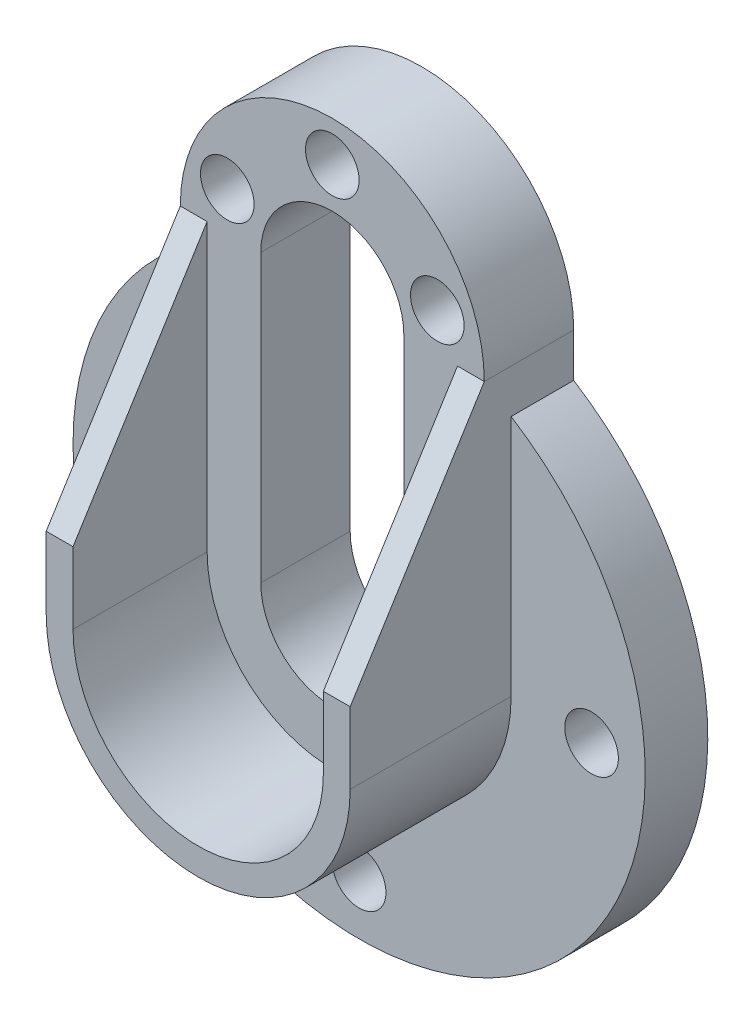
ISO-10303-21;
HEADER;
FILE_DESCRIPTION(('STEP AP214'),'2;1');
FILE_NAME('part.step','',(''),(''),'','','');
FILE_SCHEMA(('AUTOMOTIVE_DESIGN { 1 0 10303 214 1 1 1 1 }'));
ENDSEC;
DATA;
#1=APPLICATION_CONTEXT('core data for automotive mechanical design processes');
#2=APPLICATION_PROTOCOL_DEFINITION('international standard','automotive_design',2000,#1);
#3=PRODUCT_CONTEXT('',#1,'mechanical');
#4=PRODUCT('Part','Part','',(#3));
#5=PRODUCT_RELATED_PRODUCT_CATEGORY('part','',(#4));
#6=PRODUCT_DEFINITION_FORMATION('','',#4);
#7=PRODUCT_DEFINITION_CONTEXT('part definition',#1,'design');
#8=PRODUCT_DEFINITION('design','',#6,#7);
#9=PRODUCT_DEFINITION_SHAPE('','',#8);
#10=(LENGTH_UNIT() NAMED_UNIT(*) SI_UNIT(.MILLI.,.METRE.));
#11=(NAMED_UNIT(*) PLANE_ANGLE_UNIT() SI_UNIT($,.RADIAN.));
#12=(NAMED_UNIT(*) SI_UNIT($,.STERADIAN.) SOLID_ANGLE_UNIT());
#13=UNCERTAINTY_MEASURE_WITH_UNIT(LENGTH_MEASURE(1.E-05),#10,'distance_accuracy_value','');
#14=(GEOMETRIC_REPRESENTATION_CONTEXT(3) GLOBAL_UNCERTAINTY_ASSIGNED_CONTEXT((#13)) GLOBAL_UNIT_ASSIGNED_CONTEXT((#10,
#11,#12)) REPRESENTATION_CONTEXT('',''));
#15=CARTESIAN_POINT('',(0.,0.,0.));
#16=DIRECTION('',(0.,0.,1.));
#17=DIRECTION('',(1.,0.,0.));
#18=AXIS2_PLACEMENT_3D('',#15,#16,#17);
#19=CARTESIAN_POINT('',(0.,0.,15.875));
#20=DIRECTION('',(0.,0.,1.));
#21=DIRECTION('',(1.,0.,0.));
#22=AXIS2_PLACEMENT_3D('',#19,#20,#21);
#23=PLANE('',#22);
#24=DIRECTION('',(0.,-1.,0.));
#25=VECTOR('',#24,1.);
#26=CARTESIAN_POINT('',(-12.7,0.,15.875));
#27=LINE('',#26,#25);
#28=CARTESIAN_POINT('',(-12.7,50.8,15.875));
#29=VERTEX_POINT('',#28);
#30=CARTESIAN_POINT('',(-12.7,0.,15.875));
#31=VERTEX_POINT('',#30);
#32=EDGE_CURVE('E179',#29,#31,#27,.T.);
#33=ORIENTED_EDGE('',*,*,#32,.F.);
#34=CARTESIAN_POINT('',(0.,50.8,15.875));
#35=DIRECTION('',(0.,0.,1.));
#36=DIRECTION('',(1.,0.,0.));
#37=AXIS2_PLACEMENT_3D('',#34,#35,#36);
#38=CIRCLE('',#37,12.7);
#39=CARTESIAN_POINT('',(12.7,50.8,15.875));
#40=VERTEX_POINT('',#39);
#41=EDGE_CURVE('E182',#40,#29,#38,.T.);
#42=ORIENTED_EDGE('',*,*,#41,.F.);
#43=DIRECTION('',(0.,-1.,0.));
#44=VECTOR('',#43,1.);
#45=CARTESIAN_POINT('',(12.7,0.,15.875));
#46=LINE('',#45,#44);
#47=CARTESIAN_POINT('',(12.7,0.,15.875));
#48=VERTEX_POINT('',#47);
#49=EDGE_CURVE('E185',#40,#48,#46,.T.);
#50=ORIENTED_EDGE('',*,*,#49,.T.);
#51=CARTESIAN_POINT('',(0.,0.,15.875));
#52=DIRECTION('',(0.,0.,1.));
#53=DIRECTION('',(1.,0.,0.));
#54=AXIS2_PLACEMENT_3D('',#51,#52,#53);
#55=CIRCLE('',#54,12.7);
#56=EDGE_CURVE('E176',#31,#48,#55,.T.);
#57=ORIENTED_EDGE('',*,*,#56,.F.);
#58=EDGE_LOOP('',(#33,#42,#50,#57));
#59=FACE_BOUND('',#58,.T.);
#60=DIRECTION('',(1.,0.,0.));
#61=VECTOR('',#60,1.);
#62=CARTESIAN_POINT('',(0.,50.8,15.875));
#63=LINE('',#62,#61);
#64=CARTESIAN_POINT('',(-26.9875,50.8,15.875));
#65=VERTEX_POINT('',#64);
#66=CARTESIAN_POINT('',(-22.225,50.8,15.875));
#67=VERTEX_POINT('',#66);
#68=EDGE_CURVE('E146',#65,#67,#63,.T.);
#69=ORIENTED_EDGE('',*,*,#68,.T.);
#70=DIRECTION('',(0.,-1.,0.));
#71=VECTOR('',#70,1.);
#72=CARTESIAN_POINT('',(-22.225,0.,15.875));
#73=LINE('',#72,#71);
#74=CARTESIAN_POINT('',(-22.225,0.,15.875));
#75=VERTEX_POINT('',#74);
#76=EDGE_CURVE('E287',#67,#75,#73,.T.);
#77=ORIENTED_EDGE('',*,*,#76,.T.);
#78=CARTESIAN_POINT('',(0.,0.,15.875));
#79=DIRECTION('',(0.,0.,1.));
#80=DIRECTION('',(1.,0.,0.));
#81=AXIS2_PLACEMENT_3D('',#78,#79,#80);
#82=CIRCLE('',#81,22.225);
#83=CARTESIAN_POINT('',(22.225,0.,15.875));
#84=VERTEX_POINT('',#83);
#85=EDGE_CURVE('E284',#84,#75,#82,.F.);
#86=ORIENTED_EDGE('',*,*,#85,.F.);
#87=DIRECTION('',(0.,-1.,0.));
#88=VECTOR('',#87,1.);
#89=CARTESIAN_POINT('',(22.225,0.,15.875));
#90=LINE('',#89,#88);
#91=CARTESIAN_POINT('',(22.225,50.8,15.875));
#92=VERTEX_POINT('',#91);
#93=EDGE_CURVE('E270',#92,#84,#90,.T.);
#94=ORIENTED_EDGE('',*,*,#93,.F.);
#95=DIRECTION('',(-1.,0.,0.));
#96=VECTOR('',#95,1.);
#97=CARTESIAN_POINT('',(0.,50.8,15.875));
#98=LINE('',#97,#96);
#99=CARTESIAN_POINT('',(26.9875,50.8,15.875));
#100=VERTEX_POINT('',#99);
#101=EDGE_CURVE('E282',#100,#92,#98,.T.);
#102=ORIENTED_EDGE('',*,*,#101,.F.);
#103=CARTESIAN_POINT('',(0.,50.8,15.875));
#104=DIRECTION('',(0.,0.,1.));
#105=DIRECTION('',(1.,0.,0.));
#106=AXIS2_PLACEMENT_3D('',#103,#104,#105);
#107=CIRCLE('',#106,26.9875);
#108=EDGE_CURVE('E173',#100,#65,#107,.T.);
#109=ORIENTED_EDGE('',*,*,#108,.T.);
#110=EDGE_LOOP('',(#69,#77,#86,#94,#102,#109));
#111=FACE_BOUND('',#110,.T.);
#112=CARTESIAN_POINT('',(-18.6470254437204,57.5869622191188,15.875));
#113=DIRECTION('',(0.,0.,1.));
#114=DIRECTION('',(1.,0.,0.));
#115=AXIS2_PLACEMENT_3D('',#112,#113,#114);
#116=CIRCLE('',#115,4.7625);
#117=CARTESIAN_POINT('',(-13.8845254437204,57.5869622191188,15.875));
#118=VERTEX_POINT('',#117);
#119=EDGE_CURVE('E188',#118,#118,#116,.T.);
#120=ORIENTED_EDGE('',*,*,#119,.F.);
#121=EDGE_LOOP('',(#120));
#122=FACE_BOUND('',#121,.T.);
#123=CARTESIAN_POINT('',(0.,70.64375,15.875));
#124=DIRECTION('',(0.,0.,1.));
#125=DIRECTION('',(1.,0.,0.));
#126=AXIS2_PLACEMENT_3D('',#123,#124,#125);
#127=CIRCLE('',#126,4.7625);
#128=CARTESIAN_POINT('',(4.7625,70.64375,15.875));
#129=VERTEX_POINT('',#128);
#130=EDGE_CURVE('E191',#129,#129,#127,.T.);
#131=ORIENTED_EDGE('',*,*,#130,.F.);
#132=EDGE_LOOP('',(#131));
#133=FACE_BOUND('',#132,.T.);
#134=CARTESIAN_POINT('',(18.6470254437203,57.5869622191188,15.875));
#135=DIRECTION('',(0.,0.,1.));
#136=DIRECTION('',(1.,0.,0.));
#137=AXIS2_PLACEMENT_3D('',#134,#135,#136);
#138=CIRCLE('',#137,4.7625);
#139=CARTESIAN_POINT('',(23.4095254437203,57.5869622191188,15.875));
#140=VERTEX_POINT('',#139);
#141=EDGE_CURVE('E194',#140,#140,#138,.F.);
#142=ORIENTED_EDGE('',*,*,#141,.T.);
#143=EDGE_LOOP('',(#142));
#144=FACE_BOUND('',#143,.T.);
#145=ADVANCED_FACE('F35',(#59,#111,#122,#133,#144),#23,.T.);
#146=CARTESIAN_POINT('',(0.,0.,11.1125));
#147=DIRECTION('',(0.,0.,1.));
#148=DIRECTION('',(1.,0.,0.));
#149=AXIS2_PLACEMENT_3D('',#146,#147,#148);
#150=PLANE('',#149);
#151=CARTESIAN_POINT('',(41.275,0.,11.1125));
#152=DIRECTION('',(0.,0.,1.));
#153=DIRECTION('',(1.,0.,0.));
#154=AXIS2_PLACEMENT_3D('',#151,#152,#153);
#155=CIRCLE('',#154,4.7625);
#156=CARTESIAN_POINT('',(46.0375,0.,11.1125));
#157=VERTEX_POINT('',#156);
#158=EDGE_CURVE('E221',#157,#157,#155,.T.);
#159=ORIENTED_EDGE('',*,*,#158,.F.);
#160=EDGE_LOOP('',(#159));
#161=FACE_BOUND('',#160,.T.);
#162=CARTESIAN_POINT('',(-1.4411089226075E-13,-41.275,11.1125));
#163=DIRECTION('',(0.,0.,1.));
#164=DIRECTION('',(1.,0.,0.));
#165=AXIS2_PLACEMENT_3D('',#162,#163,#164);
#166=CIRCLE('',#165,4.7625);
#167=CARTESIAN_POINT('',(4.76249999999985,-41.275,11.1125));
#168=VERTEX_POINT('',#167);
#169=EDGE_CURVE('E218',#168,#168,#166,.T.);
#170=ORIENTED_EDGE('',*,*,#169,.F.);
#171=EDGE_LOOP('',(#170));
#172=FACE_BOUND('',#171,.T.);
#173=CARTESIAN_POINT('',(-41.275,2.88221784521501E-13,11.1125));
#174=DIRECTION('',(0.,0.,1.));
#175=DIRECTION('',(1.,0.,0.));
#176=AXIS2_PLACEMENT_3D('',#173,#174,#175);
#177=CIRCLE('',#176,4.76249999999999);
#178=CARTESIAN_POINT('',(-36.5125,2.88221784521501E-13,11.1125));
#179=VERTEX_POINT('',#178);
#180=EDGE_CURVE('E214',#179,#179,#177,.T.);
#181=ORIENTED_EDGE('',*,*,#180,.F.);
#182=EDGE_LOOP('',(#181));
#183=FACE_BOUND('',#182,.T.);
#184=CARTESIAN_POINT('',(0.,0.,11.1125));
#185=DIRECTION('',(0.,0.,1.));
#186=DIRECTION('',(1.,0.,0.));
#187=AXIS2_PLACEMENT_3D('',#184,#185,#186);
#188=CIRCLE('',#187,26.9875);
#189=CARTESIAN_POINT('',(26.9875,0.,11.1125));
#190=VERTEX_POINT('',#189);
#191=CARTESIAN_POINT('',(-26.9875,0.,11.1125));
#192=VERTEX_POINT('',#191);
#193=EDGE_CURVE('E205',#190,#192,#188,.F.);
#194=ORIENTED_EDGE('',*,*,#193,.T.);
#195=DIRECTION('',(0.,1.,0.));
#196=VECTOR('',#195,1.);
#197=CARTESIAN_POINT('',(-26.9875,0.,11.1125));
#198=LINE('',#197,#196);
#199=CARTESIAN_POINT('',(-26.9875,43.0385274347299,11.1125));
#200=VERTEX_POINT('',#199);
#201=EDGE_CURVE('E208',#192,#200,#198,.T.);
#202=ORIENTED_EDGE('',*,*,#201,.T.);
#203=CARTESIAN_POINT('',(0.,0.,11.1125));
#204=DIRECTION('',(0.,0.,1.));
#205=DIRECTION('',(1.,0.,0.));
#206=AXIS2_PLACEMENT_3D('',#203,#204,#205);
#207=CIRCLE('',#206,50.8);
#208=CARTESIAN_POINT('',(26.9875,43.0385274347299,11.1125));
#209=VERTEX_POINT('',#208);
#210=EDGE_CURVE('E211',#200,#209,#207,.T.);
#211=ORIENTED_EDGE('',*,*,#210,.T.);
#212=DIRECTION('',(0.,-1.,0.));
#213=VECTOR('',#212,1.);
#214=CARTESIAN_POINT('',(26.9875,0.,11.1125));
#215=LINE('',#214,#213);
#216=EDGE_CURVE('E202',#209,#190,#215,.T.);
#217=ORIENTED_EDGE('',*,*,#216,.T.);
#218=EDGE_LOOP('',(#194,#202,#211,#217));
#219=FACE_BOUND('',#218,.T.);
#220=ADVANCED_FACE('F324',(#161,#172,#183,#219),#150,.T.);
#221=CARTESIAN_POINT('',(0.,0.,11.1125));
#222=DIRECTION('',(0.,0.,-1.));
#223=DIRECTION('',(-1.,0.,0.));
#224=AXIS2_PLACEMENT_3D('',#221,#222,#223);
#225=CYLINDRICAL_SURFACE('',#224,12.7);
#226=CARTESIAN_POINT('',(0.,0.,0.));
#227=DIRECTION('',(0.,0.,1.));
#228=DIRECTION('',(1.,0.,0.));
#229=AXIS2_PLACEMENT_3D('',#226,#227,#228);
#230=CIRCLE('',#229,12.7);
#231=CARTESIAN_POINT('',(-12.7,0.,0.));
#232=VERTEX_POINT('',#231);
#233=CARTESIAN_POINT('',(12.7,0.,0.));
#234=VERTEX_POINT('',#233);
#235=EDGE_CURVE('E241',#232,#234,#230,.T.);
#236=ORIENTED_EDGE('',*,*,#235,.F.);
#237=DIRECTION('',(0.,0.,-1.));
#238=VECTOR('',#237,1.);
#239=CARTESIAN_POINT('',(-12.7,0.,11.1125));
#240=LINE('',#239,#238);
#241=EDGE_CURVE('E268',#31,#232,#240,.T.);
#242=ORIENTED_EDGE('',*,*,#241,.F.);
#243=ORIENTED_EDGE('',*,*,#56,.T.);
#244=DIRECTION('',(0.,0.,-1.));
#245=VECTOR('',#244,1.);
#246=CARTESIAN_POINT('',(12.7,0.,11.1125));
#247=LINE('',#246,#245);
#248=EDGE_CURVE('E261',#48,#234,#247,.T.);
#249=ORIENTED_EDGE('',*,*,#248,.T.);
#250=EDGE_LOOP('',(#236,#242,#243,#249));
#251=FACE_BOUND('',#250,.T.);
#252=ADVANCED_FACE('F349',(#251),#225,.F.);
#253=CARTESIAN_POINT('',(-12.7,0.,11.1125));
#254=DIRECTION('',(1.,0.,0.));
#255=DIRECTION('',(0.,1.,0.));
#256=AXIS2_PLACEMENT_3D('',#253,#254,#255);
#257=PLANE('',#256);
#258=DIRECTION('',(0.,-1.,0.));
#259=VECTOR('',#258,1.);
#260=CARTESIAN_POINT('',(-12.7,0.,0.));
#261=LINE('',#260,#259);
#262=CARTESIAN_POINT('',(-12.7,50.8,0.));
#263=VERTEX_POINT('',#262);
#264=EDGE_CURVE('E244',#263,#232,#261,.T.);
#265=ORIENTED_EDGE('',*,*,#264,.F.);
#266=DIRECTION('',(0.,0.,-1.));
#267=VECTOR('',#266,1.);
#268=CARTESIAN_POINT('',(-12.7,50.8,11.1125));
#269=LINE('',#268,#267);
#270=EDGE_CURVE('E266',#29,#263,#269,.T.);
#271=ORIENTED_EDGE('',*,*,#270,.F.);
#272=ORIENTED_EDGE('',*,*,#32,.T.);
#273=ORIENTED_EDGE('',*,*,#241,.T.);
#274=EDGE_LOOP('',(#265,#271,#272,#273));
#275=FACE_BOUND('',#274,.T.);
#276=ADVANCED_FACE('F340',(#275),#257,.T.);
#277=CARTESIAN_POINT('',(0.,50.8,11.1125));
#278=DIRECTION('',(0.,0.,-1.));
#279=DIRECTION('',(-1.,0.,0.));
#280=AXIS2_PLACEMENT_3D('',#277,#278,#279);
#281=CYLINDRICAL_SURFACE('',#280,12.7);
#282=CARTESIAN_POINT('',(0.,50.8,0.));
#283=DIRECTION('',(0.,0.,1.));
#284=DIRECTION('',(1.,0.,0.));
#285=AXIS2_PLACEMENT_3D('',#282,#283,#284);
#286=CIRCLE('',#285,12.7);
#287=CARTESIAN_POINT('',(12.7,50.8,0.));
#288=VERTEX_POINT('',#287);
#289=EDGE_CURVE('E247',#288,#263,#286,.T.);
#290=ORIENTED_EDGE('',*,*,#289,.F.);
#291=DIRECTION('',(0.,0.,-1.));
#292=VECTOR('',#291,1.);
#293=CARTESIAN_POINT('',(12.7,50.8,11.1125));
#294=LINE('',#293,#292);
#295=EDGE_CURVE('E263',#40,#288,#294,.T.);
#296=ORIENTED_EDGE('',*,*,#295,.F.);
#297=ORIENTED_EDGE('',*,*,#41,.T.);
#298=ORIENTED_EDGE('',*,*,#270,.T.);
#299=EDGE_LOOP('',(#290,#296,#297,#298));
#300=FACE_BOUND('',#299,.T.);
#301=ADVANCED_FACE('F335',(#300),#281,.F.);
#302=CARTESIAN_POINT('',(0.,50.8,11.1125));
#303=DIRECTION('',(0.,0.,-1.));
#304=DIRECTION('',(-1.,0.,0.));
#305=AXIS2_PLACEMENT_3D('',#302,#303,#304);
#306=CYLINDRICAL_SURFACE('',#305,26.9875);
#307=CARTESIAN_POINT('',(0.,50.8,0.));
#308=DIRECTION('',(0.,0.,1.));
#309=DIRECTION('',(1.,0.,0.));
#310=AXIS2_PLACEMENT_3D('',#307,#308,#309);
#311=CIRCLE('',#310,26.9875);
#312=CARTESIAN_POINT('',(26.9875,50.8,0.));
#313=VERTEX_POINT('',#312);
#314=CARTESIAN_POINT('',(-26.9875,50.8,0.));
#315=VERTEX_POINT('',#314);
#316=EDGE_CURVE('E210',#313,#315,#311,.T.);
#317=ORIENTED_EDGE('',*,*,#316,.T.);
#318=DIRECTION('',(0.,0.,-1.));
#319=VECTOR('',#318,1.);
#320=CARTESIAN_POINT('',(-26.9875,50.8,11.1125));
#321=LINE('',#320,#319);
#322=EDGE_CURVE('E264',#65,#315,#321,.T.);
#323=ORIENTED_EDGE('',*,*,#322,.F.);
#324=ORIENTED_EDGE('',*,*,#108,.F.);
#325=DIRECTION('',(0.,0.,-1.));
#326=VECTOR('',#325,1.);
#327=CARTESIAN_POINT('',(26.9875,50.8,11.1125));
#328=LINE('',#327,#326);
#329=EDGE_CURVE('E153',#100,#313,#328,.T.);
#330=ORIENTED_EDGE('',*,*,#329,.T.);
#331=EDGE_LOOP('',(#317,#323,#324,#330));
#332=FACE_BOUND('',#331,.T.);
#333=ADVANCED_FACE('F37',(#332),#306,.T.);
#334=CARTESIAN_POINT('',(-26.9875,0.,11.1125));
#335=DIRECTION('',(1.,0.,0.));
#336=DIRECTION('',(0.,1.,0.));
#337=AXIS2_PLACEMENT_3D('',#334,#335,#336);
#338=PLANE('',#337);
#339=DIRECTION('',(0.,-1.,0.));
#340=VECTOR('',#339,1.);
#341=CARTESIAN_POINT('',(-26.9875,0.,39.6875));
#342=LINE('',#341,#340);
#343=CARTESIAN_POINT('',(-26.9875,12.7,39.6875));
#344=VERTEX_POINT('',#343);
#345=CARTESIAN_POINT('',(-26.9875,0.,39.6875));
#346=VERTEX_POINT('',#345);
#347=EDGE_CURVE('E164',#344,#346,#342,.T.);
#348=ORIENTED_EDGE('',*,*,#347,.F.);
#349=DIRECTION('',(0.,0.847998304005088,-0.52999894000318));
#350=VECTOR('',#349,1.);
#351=CARTESIAN_POINT('',(-26.9875,16.4101123595506,37.3686797752809));
#352=LINE('',#351,#350);
#353=EDGE_CURVE('E57',#344,#65,#352,.T.);
#354=ORIENTED_EDGE('',*,*,#353,.T.);
#355=ORIENTED_EDGE('',*,*,#322,.T.);
#356=DIRECTION('',(0.,-1.,0.));
#357=VECTOR('',#356,1.);
#358=CARTESIAN_POINT('',(-26.9875,0.,0.));
#359=LINE('',#358,#357);
#360=CARTESIAN_POINT('',(-26.9875,43.0385274347299,0.));
#361=VERTEX_POINT('',#360);
#362=EDGE_CURVE('E226',#315,#361,#359,.T.);
#363=ORIENTED_EDGE('',*,*,#362,.T.);
#364=DIRECTION('',(0.,0.,-1.));
#365=VECTOR('',#364,1.);
#366=CARTESIAN_POINT('',(-26.9875,43.0385274347299,11.1125));
#367=LINE('',#366,#365);
#368=EDGE_CURVE('E275',#200,#361,#367,.T.);
#369=ORIENTED_EDGE('',*,*,#368,.F.);
#370=ORIENTED_EDGE('',*,*,#201,.F.);
#371=DIRECTION('',(0.,0.,-1.));
#372=VECTOR('',#371,1.);
#373=CARTESIAN_POINT('',(-26.9875,0.,15.875));
#374=LINE('',#373,#372);
#375=EDGE_CURVE('E199',#346,#192,#374,.T.);
#376=ORIENTED_EDGE('',*,*,#375,.F.);
#377=EDGE_LOOP('',(#348,#354,#355,#363,#369,#370,#376));
#378=FACE_BOUND('',#377,.T.);
#379=ADVANCED_FACE('F315',(#378),#338,.F.);
#380=CARTESIAN_POINT('',(0.,0.,11.1125));
#381=DIRECTION('',(0.,0.,-1.));
#382=DIRECTION('',(-1.,0.,0.));
#383=AXIS2_PLACEMENT_3D('',#380,#381,#382);
#384=CYLINDRICAL_SURFACE('',#383,50.8);
#385=CARTESIAN_POINT('',(0.,0.,0.));
#386=DIRECTION('',(0.,0.,1.));
#387=DIRECTION('',(1.,0.,0.));
#388=AXIS2_PLACEMENT_3D('',#385,#386,#387);
#389=CIRCLE('',#388,50.8);
#390=CARTESIAN_POINT('',(26.9875,43.0385274347299,0.));
#391=VERTEX_POINT('',#390);
#392=EDGE_CURVE('E228',#361,#391,#389,.T.);
#393=ORIENTED_EDGE('',*,*,#392,.T.);
#394=DIRECTION('',(0.,0.,-1.));
#395=VECTOR('',#394,1.);
#396=CARTESIAN_POINT('',(26.9875,43.0385274347299,11.1125));
#397=LINE('',#396,#395);
#398=EDGE_CURVE('E272',#209,#391,#397,.T.);
#399=ORIENTED_EDGE('',*,*,#398,.F.);
#400=ORIENTED_EDGE('',*,*,#210,.F.);
#401=ORIENTED_EDGE('',*,*,#368,.T.);
#402=EDGE_LOOP('',(#393,#399,#400,#401));
#403=FACE_BOUND('',#402,.T.);
#404=ADVANCED_FACE('F326',(#403),#384,.T.);
#405=CARTESIAN_POINT('',(0.,70.64375,11.1125));
#406=DIRECTION('',(0.,0.,-1.));
#407=DIRECTION('',(-1.,0.,0.));
#408=AXIS2_PLACEMENT_3D('',#405,#406,#407);
#409=CYLINDRICAL_SURFACE('',#408,4.7625);
#410=CARTESIAN_POINT('',(0.,70.64375,0.));
#411=DIRECTION('',(0.,0.,1.));
#412=DIRECTION('',(1.,0.,0.));
#413=AXIS2_PLACEMENT_3D('',#410,#411,#412);
#414=CIRCLE('',#413,4.7625);
#415=CARTESIAN_POINT('',(4.7625,70.64375,0.));
#416=VERTEX_POINT('',#415);
#417=EDGE_CURVE('E256',#416,#416,#414,.T.);
#418=ORIENTED_EDGE('',*,*,#417,.F.);
#419=EDGE_LOOP('',(#418));
#420=FACE_BOUND('',#419,.T.);
#421=ORIENTED_EDGE('',*,*,#130,.T.);
#422=EDGE_LOOP('',(#421));
#423=FACE_BOUND('',#422,.T.);
#424=ADVANCED_FACE('F364',(#420,#423),#409,.F.);
#425=CARTESIAN_POINT('',(-18.6470254437204,57.5869622191188,11.1125));
#426=DIRECTION('',(0.,0.,-1.));
#427=DIRECTION('',(-1.,0.,0.));
#428=AXIS2_PLACEMENT_3D('',#425,#426,#427);
#429=CYLINDRICAL_SURFACE('',#428,4.7625);
#430=CARTESIAN_POINT('',(-18.6470254437204,57.5869622191188,0.));
#431=DIRECTION('',(0.,0.,1.));
#432=DIRECTION('',(1.,0.,0.));
#433=AXIS2_PLACEMENT_3D('',#430,#431,#432);
#434=CIRCLE('',#433,4.7625);
#435=CARTESIAN_POINT('',(-13.8845254437204,57.5869622191188,0.));
#436=VERTEX_POINT('',#435);
#437=EDGE_CURVE('E253',#436,#436,#434,.T.);
#438=ORIENTED_EDGE('',*,*,#437,.F.);
#439=EDGE_LOOP('',(#438));
#440=FACE_BOUND('',#439,.T.);
#441=ORIENTED_EDGE('',*,*,#119,.T.);
#442=EDGE_LOOP('',(#441));
#443=FACE_BOUND('',#442,.T.);
#444=ADVANCED_FACE('F367',(#440,#443),#429,.F.);
#445=CARTESIAN_POINT('',(12.7,0.,11.1125));
#446=DIRECTION('',(1.,0.,0.));
#447=DIRECTION('',(0.,1.,0.));
#448=AXIS2_PLACEMENT_3D('',#445,#446,#447);
#449=PLANE('',#448);
#450=DIRECTION('',(0.,-1.,0.));
#451=VECTOR('',#450,1.);
#452=CARTESIAN_POINT('',(12.7,0.,0.));
#453=LINE('',#452,#451);
#454=EDGE_CURVE('E250',#288,#234,#453,.T.);
#455=ORIENTED_EDGE('',*,*,#454,.T.);
#456=ORIENTED_EDGE('',*,*,#248,.F.);
#457=ORIENTED_EDGE('',*,*,#49,.F.);
#458=ORIENTED_EDGE('',*,*,#295,.T.);
#459=EDGE_LOOP('',(#455,#456,#457,#458));
#460=FACE_BOUND('',#459,.T.);
#461=ADVANCED_FACE('F371',(#460),#449,.F.);
#462=CARTESIAN_POINT('',(41.275,0.,11.1125));
#463=DIRECTION('',(0.,0.,-1.));
#464=DIRECTION('',(-1.,0.,0.));
#465=AXIS2_PLACEMENT_3D('',#462,#463,#464);
#466=CYLINDRICAL_SURFACE('',#465,4.7625);
#467=ORIENTED_EDGE('',*,*,#158,.T.);
#468=EDGE_LOOP('',(#467));
#469=FACE_BOUND('',#468,.T.);
#470=CARTESIAN_POINT('',(41.275,0.,0.));
#471=DIRECTION('',(0.,0.,1.));
#472=DIRECTION('',(1.,0.,0.));
#473=AXIS2_PLACEMENT_3D('',#470,#471,#472);
#474=CIRCLE('',#473,4.7625);
#475=CARTESIAN_POINT('',(46.0375,0.,0.));
#476=VERTEX_POINT('',#475);
#477=EDGE_CURVE('E238',#476,#476,#474,.T.);
#478=ORIENTED_EDGE('',*,*,#477,.F.);
#479=EDGE_LOOP('',(#478));
#480=FACE_BOUND('',#479,.T.);
#481=ADVANCED_FACE('F374',(#469,#480),#466,.F.);
#482=CARTESIAN_POINT('',(-1.4411089226075E-13,-41.275,11.1125));
#483=DIRECTION('',(0.,0.,-1.));
#484=DIRECTION('',(-1.,0.,0.));
#485=AXIS2_PLACEMENT_3D('',#482,#483,#484);
#486=CYLINDRICAL_SURFACE('',#485,4.7625);
#487=ORIENTED_EDGE('',*,*,#169,.T.);
#488=EDGE_LOOP('',(#487));
#489=FACE_BOUND('',#488,.T.);
#490=CARTESIAN_POINT('',(-1.4411089226075E-13,-41.275,0.));
#491=DIRECTION('',(0.,0.,1.));
#492=DIRECTION('',(1.,0.,0.));
#493=AXIS2_PLACEMENT_3D('',#490,#491,#492);
#494=CIRCLE('',#493,4.7625);
#495=CARTESIAN_POINT('',(4.76249999999985,-41.275,0.));
#496=VERTEX_POINT('',#495);
#497=EDGE_CURVE('E235',#496,#496,#494,.T.);
#498=ORIENTED_EDGE('',*,*,#497,.F.);
#499=EDGE_LOOP('',(#498));
#500=FACE_BOUND('',#499,.T.);
#501=ADVANCED_FACE('F385',(#489,#500),#486,.F.);
#502=CARTESIAN_POINT('',(-41.275,2.88221784521501E-13,11.1125));
#503=DIRECTION('',(0.,0.,-1.));
#504=DIRECTION('',(-1.,0.,0.));
#505=AXIS2_PLACEMENT_3D('',#502,#503,#504);
#506=CYLINDRICAL_SURFACE('',#505,4.76249999999999);
#507=ORIENTED_EDGE('',*,*,#180,.T.);
#508=EDGE_LOOP('',(#507));
#509=FACE_BOUND('',#508,.T.);
#510=CARTESIAN_POINT('',(-41.275,2.88221784521501E-13,0.));
#511=DIRECTION('',(0.,0.,1.));
#512=DIRECTION('',(1.,0.,0.));
#513=AXIS2_PLACEMENT_3D('',#510,#511,#512);
#514=CIRCLE('',#513,4.76249999999999);
#515=CARTESIAN_POINT('',(-36.5125,2.88221784521501E-13,0.));
#516=VERTEX_POINT('',#515);
#517=EDGE_CURVE('E232',#516,#516,#514,.T.);
#518=ORIENTED_EDGE('',*,*,#517,.F.);
#519=EDGE_LOOP('',(#518));
#520=FACE_BOUND('',#519,.T.);
#521=ADVANCED_FACE('F389',(#509,#520),#506,.F.);
#522=CARTESIAN_POINT('',(26.9875,0.,11.1125));
#523=DIRECTION('',(-1.,0.,0.));
#524=DIRECTION('',(0.,-1.,0.));
#525=AXIS2_PLACEMENT_3D('',#522,#523,#524);
#526=PLANE('',#525);
#527=ORIENTED_EDGE('',*,*,#329,.F.);
#528=DIRECTION('',(0.,0.847998304005088,-0.52999894000318));
#529=VECTOR('',#528,1.);
#530=CARTESIAN_POINT('',(26.9875,50.8,15.875));
#531=LINE('',#530,#529);
#532=CARTESIAN_POINT('',(26.9875,12.7,39.6875));
#533=VERTEX_POINT('',#532);
#534=EDGE_CURVE('E140',#533,#100,#531,.T.);
#535=ORIENTED_EDGE('',*,*,#534,.F.);
#536=DIRECTION('',(0.,1.,0.));
#537=VECTOR('',#536,1.);
#538=CARTESIAN_POINT('',(26.9875,0.,39.6875));
#539=LINE('',#538,#537);
#540=CARTESIAN_POINT('',(26.9875,0.,39.6875));
#541=VERTEX_POINT('',#540);
#542=EDGE_CURVE('E151',#541,#533,#539,.T.);
#543=ORIENTED_EDGE('',*,*,#542,.F.);
#544=DIRECTION('',(0.,0.,-1.));
#545=VECTOR('',#544,1.);
#546=CARTESIAN_POINT('',(26.9875,0.,15.875));
#547=LINE('',#546,#545);
#548=EDGE_CURVE('E197',#541,#190,#547,.T.);
#549=ORIENTED_EDGE('',*,*,#548,.T.);
#550=ORIENTED_EDGE('',*,*,#216,.F.);
#551=ORIENTED_EDGE('',*,*,#398,.T.);
#552=DIRECTION('',(0.,1.,0.));
#553=VECTOR('',#552,1.);
#554=CARTESIAN_POINT('',(26.9875,0.,0.));
#555=LINE('',#554,#553);
#556=EDGE_CURVE('E230',#391,#313,#555,.T.);
#557=ORIENTED_EDGE('',*,*,#556,.T.);
#558=EDGE_LOOP('',(#527,#535,#543,#549,#550,#551,#557));
#559=FACE_BOUND('',#558,.T.);
#560=ADVANCED_FACE('F150',(#559),#526,.F.);
#561=CARTESIAN_POINT('',(18.6470254437203,57.5869622191188,11.1125));
#562=DIRECTION('',(0.,0.,-1.));
#563=DIRECTION('',(-1.,0.,0.));
#564=AXIS2_PLACEMENT_3D('',#561,#562,#563);
#565=CYLINDRICAL_SURFACE('',#564,4.7625);
#566=CARTESIAN_POINT('',(18.6470254437203,57.5869622191188,0.));
#567=DIRECTION('',(0.,0.,1.));
#568=DIRECTION('',(1.,0.,0.));
#569=AXIS2_PLACEMENT_3D('',#566,#567,#568);
#570=CIRCLE('',#569,4.7625);
#571=CARTESIAN_POINT('',(23.4095254437203,57.5869622191188,0.));
#572=VERTEX_POINT('',#571);
#573=EDGE_CURVE('E215',#572,#572,#570,.F.);
#574=ORIENTED_EDGE('',*,*,#573,.T.);
#575=EDGE_LOOP('',(#574));
#576=FACE_BOUND('',#575,.T.);
#577=ORIENTED_EDGE('',*,*,#141,.F.);
#578=EDGE_LOOP('',(#577));
#579=FACE_BOUND('',#578,.T.);
#580=ADVANCED_FACE('F360',(#576,#579),#565,.F.);
#581=CARTESIAN_POINT('',(0.,0.,0.));
#582=DIRECTION('',(0.,0.,1.));
#583=DIRECTION('',(1.,0.,0.));
#584=AXIS2_PLACEMENT_3D('',#581,#582,#583);
#585=PLANE('',#584);
#586=ORIENTED_EDGE('',*,*,#392,.F.);
#587=ORIENTED_EDGE('',*,*,#362,.F.);
#588=ORIENTED_EDGE('',*,*,#316,.F.);
#589=ORIENTED_EDGE('',*,*,#556,.F.);
#590=EDGE_LOOP('',(#586,#587,#588,#589));
#591=FACE_BOUND('',#590,.T.);
#592=ORIENTED_EDGE('',*,*,#573,.F.);
#593=EDGE_LOOP('',(#592));
#594=FACE_BOUND('',#593,.T.);
#595=ORIENTED_EDGE('',*,*,#417,.T.);
#596=EDGE_LOOP('',(#595));
#597=FACE_BOUND('',#596,.T.);
#598=ORIENTED_EDGE('',*,*,#437,.T.);
#599=EDGE_LOOP('',(#598));
#600=FACE_BOUND('',#599,.T.);
#601=ORIENTED_EDGE('',*,*,#235,.T.);
#602=ORIENTED_EDGE('',*,*,#454,.F.);
#603=ORIENTED_EDGE('',*,*,#289,.T.);
#604=ORIENTED_EDGE('',*,*,#264,.T.);
#605=EDGE_LOOP('',(#601,#602,#603,#604));
#606=FACE_BOUND('',#605,.T.);
#607=ORIENTED_EDGE('',*,*,#517,.T.);
#608=EDGE_LOOP('',(#607));
#609=FACE_BOUND('',#608,.T.);
#610=ORIENTED_EDGE('',*,*,#497,.T.);
#611=EDGE_LOOP('',(#610));
#612=FACE_BOUND('',#611,.T.);
#613=ORIENTED_EDGE('',*,*,#477,.T.);
#614=EDGE_LOOP('',(#613));
#615=FACE_BOUND('',#614,.T.);
#616=ADVANCED_FACE('F329',(#591,#594,#597,#600,#606,#609,#612,#615),#585,.F.);
#617=CARTESIAN_POINT('',(0.,0.,15.875));
#618=DIRECTION('',(0.,0.,-1.));
#619=DIRECTION('',(-1.,0.,0.));
#620=AXIS2_PLACEMENT_3D('',#617,#618,#619);
#621=CYLINDRICAL_SURFACE('',#620,26.9875);
#622=ORIENTED_EDGE('',*,*,#193,.F.);
#623=ORIENTED_EDGE('',*,*,#548,.F.);
#624=CARTESIAN_POINT('',(0.,0.,39.6875));
#625=DIRECTION('',(0.,0.,1.));
#626=DIRECTION('',(1.,0.,0.));
#627=AXIS2_PLACEMENT_3D('',#624,#625,#626);
#628=CIRCLE('',#627,26.9875);
#629=EDGE_CURVE('E159',#346,#541,#628,.T.);
#630=ORIENTED_EDGE('',*,*,#629,.F.);
#631=ORIENTED_EDGE('',*,*,#375,.T.);
#632=EDGE_LOOP('',(#622,#623,#630,#631));
#633=FACE_BOUND('',#632,.T.);
#634=ADVANCED_FACE('F319',(#633),#621,.T.);
#635=CARTESIAN_POINT('',(0.,0.,39.6875));
#636=DIRECTION('',(0.,0.,-1.));
#637=DIRECTION('',(-1.,0.,0.));
#638=AXIS2_PLACEMENT_3D('',#635,#636,#637);
#639=CYLINDRICAL_SURFACE('',#638,22.225);
#640=DIRECTION('',(0.,0.,-1.));
#641=VECTOR('',#640,1.);
#642=CARTESIAN_POINT('',(22.225,0.,39.6875));
#643=LINE('',#642,#641);
#644=CARTESIAN_POINT('',(22.225,0.,39.6875));
#645=VERTEX_POINT('',#644);
#646=EDGE_CURVE('E162',#645,#84,#643,.T.);
#647=ORIENTED_EDGE('',*,*,#646,.T.);
#648=ORIENTED_EDGE('',*,*,#85,.T.);
#649=DIRECTION('',(0.,0.,-1.));
#650=VECTOR('',#649,1.);
#651=CARTESIAN_POINT('',(-22.225,0.,39.6875));
#652=LINE('',#651,#650);
#653=CARTESIAN_POINT('',(-22.225,0.,39.6875));
#654=VERTEX_POINT('',#653);
#655=EDGE_CURVE('E170',#654,#75,#652,.T.);
#656=ORIENTED_EDGE('',*,*,#655,.F.);
#657=CARTESIAN_POINT('',(0.,0.,39.6875));
#658=DIRECTION('',(0.,0.,1.));
#659=DIRECTION('',(1.,0.,0.));
#660=AXIS2_PLACEMENT_3D('',#657,#658,#659);
#661=CIRCLE('',#660,22.225);
#662=EDGE_CURVE('E303',#654,#645,#661,.T.);
#663=ORIENTED_EDGE('',*,*,#662,.T.);
#664=EDGE_LOOP('',(#647,#648,#656,#663));
#665=FACE_BOUND('',#664,.T.);
#666=ADVANCED_FACE('F302',(#665),#639,.F.);
#667=CARTESIAN_POINT('',(-22.225,0.,39.6875));
#668=DIRECTION('',(-1.,0.,0.));
#669=DIRECTION('',(0.,0.,1.));
#670=AXIS2_PLACEMENT_3D('',#667,#668,#669);
#671=PLANE('',#670);
#672=ORIENTED_EDGE('',*,*,#76,.F.);
#673=DIRECTION('',(0.,-0.847998304005088,0.52999894000318));
#674=VECTOR('',#673,1.);
#675=CARTESIAN_POINT('',(-22.225,3.56741573033708,45.3953651685393));
#676=LINE('',#675,#674);
#677=CARTESIAN_POINT('',(-22.225,12.7,39.6875));
#678=VERTEX_POINT('',#677);
#679=EDGE_CURVE('E296',#67,#678,#676,.T.);
#680=ORIENTED_EDGE('',*,*,#679,.T.);
#681=DIRECTION('',(0.,1.,0.));
#682=VECTOR('',#681,1.);
#683=CARTESIAN_POINT('',(-22.225,0.,39.6875));
#684=LINE('',#683,#682);
#685=EDGE_CURVE('E298',#654,#678,#684,.T.);
#686=ORIENTED_EDGE('',*,*,#685,.F.);
#687=ORIENTED_EDGE('',*,*,#655,.T.);
#688=EDGE_LOOP('',(#672,#680,#686,#687));
#689=FACE_BOUND('',#688,.T.);
#690=ADVANCED_FACE('F294',(#689),#671,.F.);
#691=CARTESIAN_POINT('',(22.225,0.,39.6875));
#692=DIRECTION('',(-1.,0.,0.));
#693=DIRECTION('',(0.,0.,1.));
#694=AXIS2_PLACEMENT_3D('',#691,#692,#693);
#695=PLANE('',#694);
#696=DIRECTION('',(0.,-0.847998304005088,0.52999894000318));
#697=VECTOR('',#696,1.);
#698=CARTESIAN_POINT('',(22.225,3.56741573033708,45.3953651685393));
#699=LINE('',#698,#697);
#700=CARTESIAN_POINT('',(22.225,12.7,39.6875));
#701=VERTEX_POINT('',#700);
#702=EDGE_CURVE('E50',#92,#701,#699,.T.);
#703=ORIENTED_EDGE('',*,*,#702,.F.);
#704=ORIENTED_EDGE('',*,*,#93,.T.);
#705=ORIENTED_EDGE('',*,*,#646,.F.);
#706=DIRECTION('',(0.,1.,0.));
#707=VECTOR('',#706,1.);
#708=CARTESIAN_POINT('',(22.225,0.,39.6875));
#709=LINE('',#708,#707);
#710=EDGE_CURVE('E160',#645,#701,#709,.T.);
#711=ORIENTED_EDGE('',*,*,#710,.T.);
#712=EDGE_LOOP('',(#703,#704,#705,#711));
#713=FACE_BOUND('',#712,.T.);
#714=ADVANCED_FACE('F306',(#713),#695,.T.);
#715=CARTESIAN_POINT('',(0.,0.,39.6875));
#716=DIRECTION('',(0.,0.,1.));
#717=DIRECTION('',(1.,0.,0.));
#718=AXIS2_PLACEMENT_3D('',#715,#716,#717);
#719=PLANE('',#718);
#720=DIRECTION('',(1.,0.,0.));
#721=VECTOR('',#720,1.);
#722=CARTESIAN_POINT('',(0.,12.7,39.6875));
#723=LINE('',#722,#721);
#724=EDGE_CURVE('E11',#344,#678,#723,.T.);
#725=ORIENTED_EDGE('',*,*,#724,.F.);
#726=ORIENTED_EDGE('',*,*,#347,.T.);
#727=ORIENTED_EDGE('',*,*,#629,.T.);
#728=ORIENTED_EDGE('',*,*,#542,.T.);
#729=EDGE_CURVE('E39',#701,#533,#723,.T.);
#730=ORIENTED_EDGE('',*,*,#729,.F.);
#731=ORIENTED_EDGE('',*,*,#710,.F.);
#732=ORIENTED_EDGE('',*,*,#662,.F.);
#733=ORIENTED_EDGE('',*,*,#685,.T.);
#734=EDGE_LOOP('',(#725,#726,#727,#728,#730,#731,#732,#733));
#735=FACE_BOUND('',#734,.T.);
#736=ADVANCED_FACE('F157',(#735),#719,.T.);
#737=CARTESIAN_POINT('',(-50.8,50.8,15.875));
#738=DIRECTION('',(0.,-0.52999894000318,-0.847998304005088));
#739=DIRECTION('',(0.,0.847998304005088,-0.52999894000318));
#740=AXIS2_PLACEMENT_3D('',#737,#738,#739);
#741=PLANE('',#740);
#742=ORIENTED_EDGE('',*,*,#702,.T.);
#743=ORIENTED_EDGE('',*,*,#729,.T.);
#744=ORIENTED_EDGE('',*,*,#534,.T.);
#745=ORIENTED_EDGE('',*,*,#101,.T.);
#746=EDGE_LOOP('',(#742,#743,#744,#745));
#747=FACE_BOUND('',#746,.T.);
#748=ADVANCED_FACE('F139',(#747),#741,.F.);
#749=ORIENTED_EDGE('',*,*,#724,.T.);
#750=ORIENTED_EDGE('',*,*,#679,.F.);
#751=ORIENTED_EDGE('',*,*,#68,.F.);
#752=ORIENTED_EDGE('',*,*,#353,.F.);
#753=EDGE_LOOP('',(#749,#750,#751,#752));
#754=FACE_BOUND('',#753,.T.);
#755=ADVANCED_FACE('F471',(#754),#741,.F.);
#756=CLOSED_SHELL('',(#145,#220,#252,#276,#301,#333,#379,#404,#424,#444,#461,#481,#501,#521,
#560,#580,#616,#634,#666,#690,#714,#736,#748,#755));
#757=MANIFOLD_SOLID_BREP('B2',#756);
#758=ADVANCED_BREP_SHAPE_REPRESENTATION('',(#18,#757),#14);
#759=SHAPE_DEFINITION_REPRESENTATION(#9,#758);
ENDSEC;
END-ISO-10303-21;
